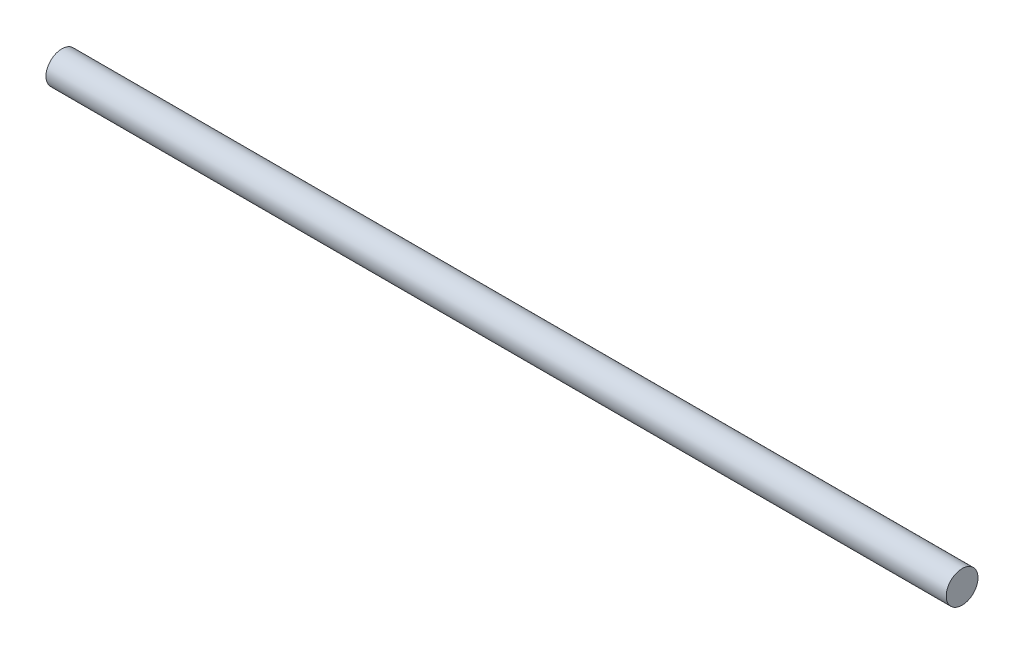
ISO-10303-21;
HEADER;
FILE_DESCRIPTION(('STEP AP214'),'2;1');
FILE_NAME('part.step','',(''),(''),'','','');
FILE_SCHEMA(('AUTOMOTIVE_DESIGN { 1 0 10303 214 1 1 1 1 }'));
ENDSEC;
DATA;
#1=APPLICATION_CONTEXT('core data for automotive mechanical design processes');
#2=APPLICATION_PROTOCOL_DEFINITION('international standard','automotive_design',2000,#1);
#3=PRODUCT_CONTEXT('',#1,'mechanical');
#4=PRODUCT('Part','Part','',(#3));
#5=PRODUCT_RELATED_PRODUCT_CATEGORY('part','',(#4));
#6=PRODUCT_DEFINITION_FORMATION('','',#4);
#7=PRODUCT_DEFINITION_CONTEXT('part definition',#1,'design');
#8=PRODUCT_DEFINITION('design','',#6,#7);
#9=PRODUCT_DEFINITION_SHAPE('','',#8);
#10=(LENGTH_UNIT() NAMED_UNIT(*) SI_UNIT(.MILLI.,.METRE.));
#11=(NAMED_UNIT(*) PLANE_ANGLE_UNIT() SI_UNIT($,.RADIAN.));
#12=(NAMED_UNIT(*) SI_UNIT($,.STERADIAN.) SOLID_ANGLE_UNIT());
#13=UNCERTAINTY_MEASURE_WITH_UNIT(LENGTH_MEASURE(1.E-05),#10,'distance_accuracy_value','');
#14=(GEOMETRIC_REPRESENTATION_CONTEXT(3) GLOBAL_UNCERTAINTY_ASSIGNED_CONTEXT((#13)) GLOBAL_UNIT_ASSIGNED_CONTEXT((#10,
#11,#12)) REPRESENTATION_CONTEXT('',''));
#15=CARTESIAN_POINT('',(0.,0.,0.));
#16=DIRECTION('',(0.,0.,1.));
#17=DIRECTION('',(1.,0.,0.));
#18=AXIS2_PLACEMENT_3D('',#15,#16,#17);
#19=CARTESIAN_POINT('',(85.,0.,0.));
#20=DIRECTION('',(-1.,0.,0.));
#21=DIRECTION('',(0.,0.,1.));
#22=AXIS2_PLACEMENT_3D('',#19,#20,#21);
#23=CYLINDRICAL_SURFACE('',#22,1.5);
#24=CARTESIAN_POINT('',(85.,0.,0.));
#25=DIRECTION('',(1.,0.,0.));
#26=DIRECTION('',(0.,0.,-1.));
#27=AXIS2_PLACEMENT_3D('',#24,#25,#26);
#28=CIRCLE('',#27,1.5);
#29=CARTESIAN_POINT('',(85.,0.,-1.5));
#30=VERTEX_POINT('',#29);
#31=EDGE_CURVE('E10',#30,#30,#28,.T.);
#32=ORIENTED_EDGE('',*,*,#31,.F.);
#33=EDGE_LOOP('',(#32));
#34=FACE_BOUND('',#33,.T.);
#35=CARTESIAN_POINT('',(0.,0.,0.));
#36=DIRECTION('',(1.,0.,0.));
#37=DIRECTION('',(0.,0.,-1.));
#38=AXIS2_PLACEMENT_3D('',#35,#36,#37);
#39=CIRCLE('',#38,1.5);
#40=CARTESIAN_POINT('',(0.,0.,-1.5));
#41=VERTEX_POINT('',#40);
#42=EDGE_CURVE('E33',#41,#41,#39,.T.);
#43=ORIENTED_EDGE('',*,*,#42,.T.);
#44=EDGE_LOOP('',(#43));
#45=FACE_BOUND('',#44,.T.);
#46=ADVANCED_FACE('F30',(#34,#45),#23,.T.);
#47=CARTESIAN_POINT('',(85.,0.,0.));
#48=DIRECTION('',(1.,0.,0.));
#49=DIRECTION('',(0.,0.,-1.));
#50=AXIS2_PLACEMENT_3D('',#47,#48,#49);
#51=PLANE('',#50);
#52=ORIENTED_EDGE('',*,*,#31,.T.);
#53=EDGE_LOOP('',(#52));
#54=FACE_BOUND('',#53,.T.);
#55=ADVANCED_FACE('F45',(#54),#51,.T.);
#56=CARTESIAN_POINT('',(0.,0.,0.));
#57=DIRECTION('',(1.,0.,0.));
#58=DIRECTION('',(0.,0.,-1.));
#59=AXIS2_PLACEMENT_3D('',#56,#57,#58);
#60=PLANE('',#59);
#61=ORIENTED_EDGE('',*,*,#42,.F.);
#62=EDGE_LOOP('',(#61));
#63=FACE_BOUND('',#62,.T.);
#64=ADVANCED_FACE('F43',(#63),#60,.F.);
#65=CLOSED_SHELL('',(#46,#55,#64));
#66=MANIFOLD_SOLID_BREP('B2',#65);
#67=ADVANCED_BREP_SHAPE_REPRESENTATION('',(#18,#66),#14);
#68=SHAPE_DEFINITION_REPRESENTATION(#9,#67);
ENDSEC;
END-ISO-10303-21;
